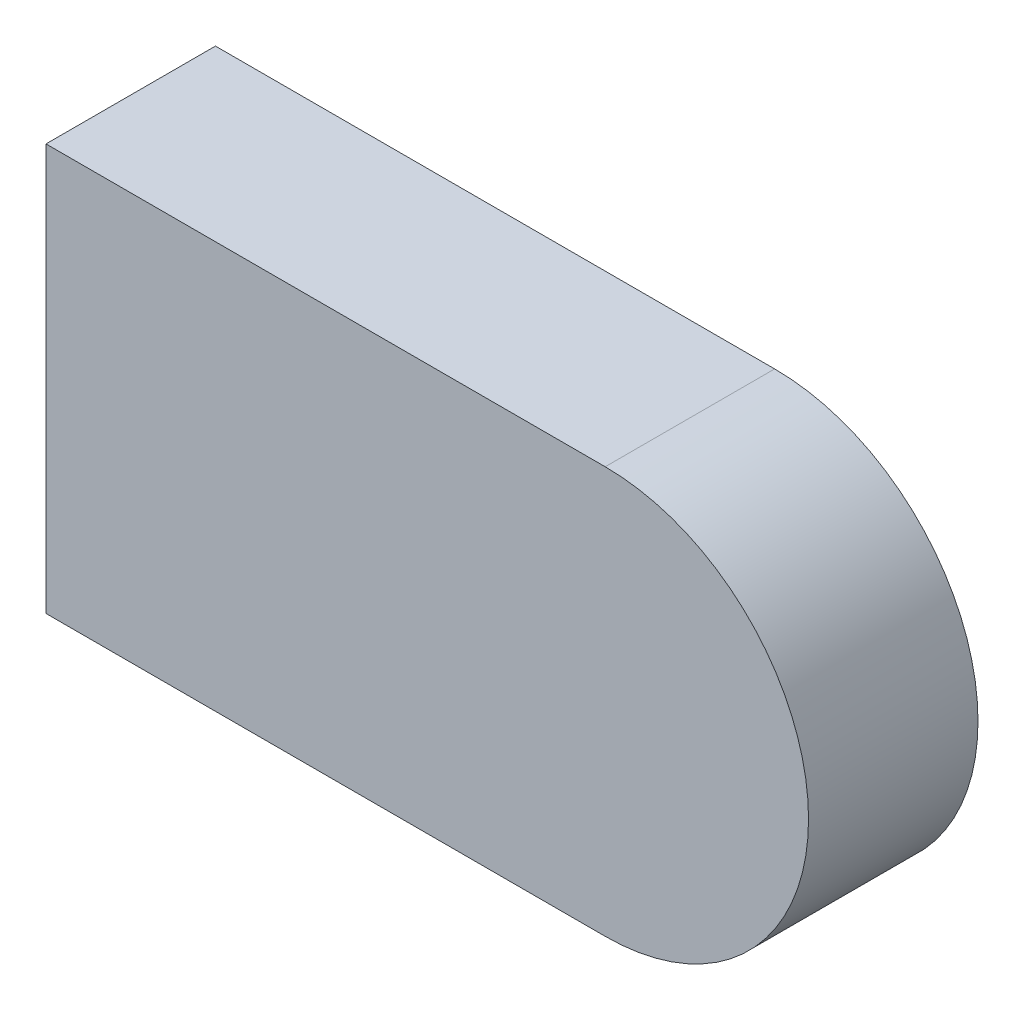
ISO-10303-21;
HEADER;
FILE_DESCRIPTION(('STEP AP214'),'2;1');
FILE_NAME('part.step','',(''),(''),'','','');
FILE_SCHEMA(('AUTOMOTIVE_DESIGN { 1 0 10303 214 1 1 1 1 }'));
ENDSEC;
DATA;
#1=APPLICATION_CONTEXT('core data for automotive mechanical design processes');
#2=APPLICATION_PROTOCOL_DEFINITION('international standard','automotive_design',2000,#1);
#3=PRODUCT_CONTEXT('',#1,'mechanical');
#4=PRODUCT('Part','Part','',(#3));
#5=PRODUCT_RELATED_PRODUCT_CATEGORY('part','',(#4));
#6=PRODUCT_DEFINITION_FORMATION('','',#4);
#7=PRODUCT_DEFINITION_CONTEXT('part definition',#1,'design');
#8=PRODUCT_DEFINITION('design','',#6,#7);
#9=PRODUCT_DEFINITION_SHAPE('','',#8);
#10=(LENGTH_UNIT() NAMED_UNIT(*) SI_UNIT(.MILLI.,.METRE.));
#11=(NAMED_UNIT(*) PLANE_ANGLE_UNIT() SI_UNIT($,.RADIAN.));
#12=(NAMED_UNIT(*) SI_UNIT($,.STERADIAN.) SOLID_ANGLE_UNIT());
#13=UNCERTAINTY_MEASURE_WITH_UNIT(LENGTH_MEASURE(1.E-05),#10,'distance_accuracy_value','');
#14=(GEOMETRIC_REPRESENTATION_CONTEXT(3) GLOBAL_UNCERTAINTY_ASSIGNED_CONTEXT((#13)) GLOBAL_UNIT_ASSIGNED_CONTEXT((#10,
#11,#12)) REPRESENTATION_CONTEXT('',''));
#15=CARTESIAN_POINT('',(0.,0.,0.));
#16=DIRECTION('',(0.,0.,1.));
#17=DIRECTION('',(1.,0.,0.));
#18=AXIS2_PLACEMENT_3D('',#15,#16,#17);
#19=CARTESIAN_POINT('',(-4.05,1.63,0.));
#20=DIRECTION('',(0.,1.,0.));
#21=DIRECTION('',(1.,0.,0.));
#22=AXIS2_PLACEMENT_3D('',#19,#20,#21);
#23=PLANE('',#22);
#24=DIRECTION('',(1.,0.,0.));
#25=VECTOR('',#24,1.);
#26=CARTESIAN_POINT('',(-4.05,1.63,0.));
#27=LINE('',#26,#25);
#28=CARTESIAN_POINT('',(-4.05,1.63,0.));
#29=VERTEX_POINT('',#28);
#30=CARTESIAN_POINT('',(-3.72,1.63,0.));
#31=VERTEX_POINT('',#30);
#32=EDGE_CURVE('E11',#29,#31,#27,.T.);
#33=ORIENTED_EDGE('',*,*,#32,.T.);
#34=DIRECTION('',(0.,0.,1.));
#35=VECTOR('',#34,1.);
#36=CARTESIAN_POINT('',(-3.72,1.63,0.));
#37=LINE('',#36,#35);
#38=CARTESIAN_POINT('',(-3.72,1.63,0.1));
#39=VERTEX_POINT('',#38);
#40=EDGE_CURVE('E24',#31,#39,#37,.T.);
#41=ORIENTED_EDGE('',*,*,#40,.T.);
#42=DIRECTION('',(1.,0.,0.));
#43=VECTOR('',#42,1.);
#44=CARTESIAN_POINT('',(-4.05,1.63,0.1));
#45=LINE('',#44,#43);
#46=CARTESIAN_POINT('',(-4.05,1.63,0.1));
#47=VERTEX_POINT('',#46);
#48=EDGE_CURVE('E88',#47,#39,#45,.T.);
#49=ORIENTED_EDGE('',*,*,#48,.F.);
#50=DIRECTION('',(0.,0.,1.));
#51=VECTOR('',#50,1.);
#52=CARTESIAN_POINT('',(-4.05,1.63,0.));
#53=LINE('',#52,#51);
#54=EDGE_CURVE('E36',#29,#47,#53,.T.);
#55=ORIENTED_EDGE('',*,*,#54,.F.);
#56=EDGE_LOOP('',(#33,#41,#49,#55));
#57=FACE_BOUND('',#56,.T.);
#58=ADVANCED_FACE('F17',(#57),#23,.F.);
#59=CARTESIAN_POINT('',(-3.72,1.75,0.));
#60=DIRECTION('',(0.,0.,-1.));
#61=DIRECTION('',(1.,0.,0.));
#62=AXIS2_PLACEMENT_3D('',#59,#60,#61);
#63=CYLINDRICAL_SURFACE('',#62,0.12);
#64=CARTESIAN_POINT('',(-3.72,1.75,0.));
#65=DIRECTION('',(0.,0.,1.));
#66=DIRECTION('',(1.,0.,0.));
#67=AXIS2_PLACEMENT_3D('',#64,#65,#66);
#68=CIRCLE('',#67,0.12);
#69=CARTESIAN_POINT('',(-3.72,1.87,0.));
#70=VERTEX_POINT('',#69);
#71=EDGE_CURVE('E85',#31,#70,#68,.T.);
#72=ORIENTED_EDGE('',*,*,#71,.T.);
#73=DIRECTION('',(0.,0.,1.));
#74=VECTOR('',#73,1.);
#75=CARTESIAN_POINT('',(-3.72,1.87,0.));
#76=LINE('',#75,#74);
#77=CARTESIAN_POINT('',(-3.72,1.87,0.1));
#78=VERTEX_POINT('',#77);
#79=EDGE_CURVE('E73',#70,#78,#76,.T.);
#80=ORIENTED_EDGE('',*,*,#79,.T.);
#81=CARTESIAN_POINT('',(-3.72,1.75,0.1));
#82=DIRECTION('',(0.,0.,1.));
#83=DIRECTION('',(1.,0.,0.));
#84=AXIS2_PLACEMENT_3D('',#81,#82,#83);
#85=CIRCLE('',#84,0.12);
#86=EDGE_CURVE('E66',#39,#78,#85,.T.);
#87=ORIENTED_EDGE('',*,*,#86,.F.);
#88=ORIENTED_EDGE('',*,*,#40,.F.);
#89=EDGE_LOOP('',(#72,#80,#87,#88));
#90=FACE_BOUND('',#89,.T.);
#91=ADVANCED_FACE('F89',(#90),#63,.T.);
#92=CARTESIAN_POINT('',(-4.05,1.87,0.));
#93=DIRECTION('',(0.,1.,0.));
#94=DIRECTION('',(1.,0.,0.));
#95=AXIS2_PLACEMENT_3D('',#92,#93,#94);
#96=PLANE('',#95);
#97=DIRECTION('',(0.,0.,1.));
#98=VECTOR('',#97,1.);
#99=CARTESIAN_POINT('',(-4.05,1.87,0.));
#100=LINE('',#99,#98);
#101=CARTESIAN_POINT('',(-4.05,1.87,0.));
#102=VERTEX_POINT('',#101);
#103=CARTESIAN_POINT('',(-4.05,1.87,0.1));
#104=VERTEX_POINT('',#103);
#105=EDGE_CURVE('E56',#102,#104,#100,.T.);
#106=ORIENTED_EDGE('',*,*,#105,.T.);
#107=DIRECTION('',(1.,0.,0.));
#108=VECTOR('',#107,1.);
#109=CARTESIAN_POINT('',(-4.05,1.87,0.1));
#110=LINE('',#109,#108);
#111=EDGE_CURVE('E67',#104,#78,#110,.T.);
#112=ORIENTED_EDGE('',*,*,#111,.T.);
#113=ORIENTED_EDGE('',*,*,#79,.F.);
#114=DIRECTION('',(1.,0.,0.));
#115=VECTOR('',#114,1.);
#116=CARTESIAN_POINT('',(-4.05,1.87,0.));
#117=LINE('',#116,#115);
#118=EDGE_CURVE('E71',#102,#70,#117,.T.);
#119=ORIENTED_EDGE('',*,*,#118,.F.);
#120=EDGE_LOOP('',(#106,#112,#113,#119));
#121=FACE_BOUND('',#120,.T.);
#122=ADVANCED_FACE('F72',(#121),#96,.T.);
#123=CARTESIAN_POINT('',(-4.05,1.63,0.));
#124=DIRECTION('',(-1.,0.,0.));
#125=DIRECTION('',(0.,1.,0.));
#126=AXIS2_PLACEMENT_3D('',#123,#124,#125);
#127=PLANE('',#126);
#128=ORIENTED_EDGE('',*,*,#54,.T.);
#129=DIRECTION('',(0.,1.,0.));
#130=VECTOR('',#129,1.);
#131=CARTESIAN_POINT('',(-4.05,1.63,0.1));
#132=LINE('',#131,#130);
#133=EDGE_CURVE('E62',#47,#104,#132,.T.);
#134=ORIENTED_EDGE('',*,*,#133,.T.);
#135=ORIENTED_EDGE('',*,*,#105,.F.);
#136=DIRECTION('',(0.,1.,0.));
#137=VECTOR('',#136,1.);
#138=CARTESIAN_POINT('',(-4.05,1.63,0.));
#139=LINE('',#138,#137);
#140=EDGE_CURVE('E60',#29,#102,#139,.T.);
#141=ORIENTED_EDGE('',*,*,#140,.F.);
#142=EDGE_LOOP('',(#128,#134,#135,#141));
#143=FACE_BOUND('',#142,.T.);
#144=ADVANCED_FACE('F58',(#143),#127,.T.);
#145=CARTESIAN_POINT('',(-3.849490847913,1.75,0.));
#146=DIRECTION('',(0.,0.,1.));
#147=DIRECTION('',(1.,0.,0.));
#148=AXIS2_PLACEMENT_3D('',#145,#146,#147);
#149=PLANE('',#148);
#150=ORIENTED_EDGE('',*,*,#140,.T.);
#151=ORIENTED_EDGE('',*,*,#118,.T.);
#152=ORIENTED_EDGE('',*,*,#71,.F.);
#153=ORIENTED_EDGE('',*,*,#32,.F.);
#154=EDGE_LOOP('',(#150,#151,#152,#153));
#155=FACE_BOUND('',#154,.T.);
#156=ADVANCED_FACE('F77',(#155),#149,.F.);
#157=CARTESIAN_POINT('',(-3.849490847913,1.75,0.1));
#158=DIRECTION('',(0.,0.,1.));
#159=DIRECTION('',(1.,0.,0.));
#160=AXIS2_PLACEMENT_3D('',#157,#158,#159);
#161=PLANE('',#160);
#162=ORIENTED_EDGE('',*,*,#48,.T.);
#163=ORIENTED_EDGE('',*,*,#86,.T.);
#164=ORIENTED_EDGE('',*,*,#111,.F.);
#165=ORIENTED_EDGE('',*,*,#133,.F.);
#166=EDGE_LOOP('',(#162,#163,#164,#165));
#167=FACE_BOUND('',#166,.T.);
#168=ADVANCED_FACE('F91',(#167),#161,.T.);
#169=CLOSED_SHELL('',(#58,#91,#122,#144,#156,#168));
#170=MANIFOLD_SOLID_BREP('B1',#169);
#171=ADVANCED_BREP_SHAPE_REPRESENTATION('',(#18,#170),#14);
#172=SHAPE_DEFINITION_REPRESENTATION(#9,#171);
ENDSEC;
END-ISO-10303-21;
